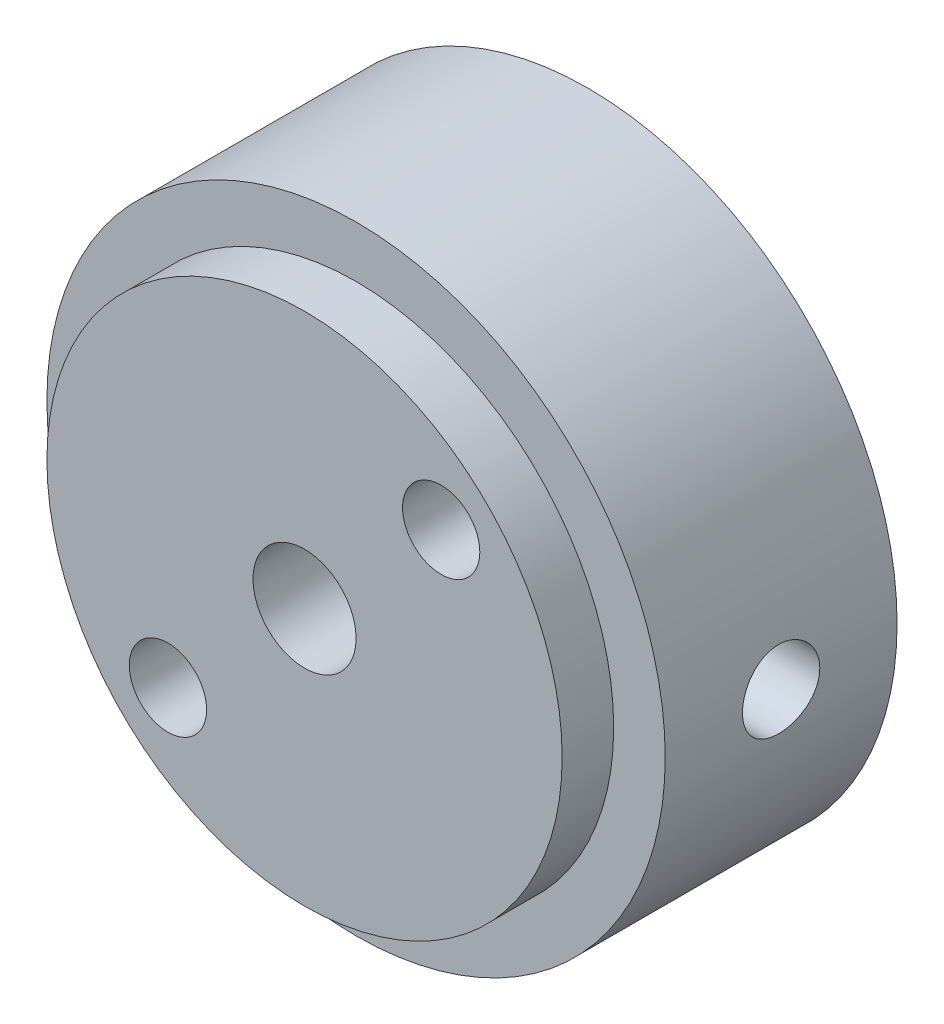
ISO-10303-21;
HEADER;
FILE_DESCRIPTION(('STEP AP214'),'2;1');
FILE_NAME('part.step','',(''),(''),'','','');
FILE_SCHEMA(('AUTOMOTIVE_DESIGN { 1 0 10303 214 1 1 1 1 }'));
ENDSEC;
DATA;
#1=APPLICATION_CONTEXT('core data for automotive mechanical design processes');
#2=APPLICATION_PROTOCOL_DEFINITION('international standard','automotive_design',2000,#1);
#3=PRODUCT_CONTEXT('',#1,'mechanical');
#4=PRODUCT('Part','Part','',(#3));
#5=PRODUCT_RELATED_PRODUCT_CATEGORY('part','',(#4));
#6=PRODUCT_DEFINITION_FORMATION('','',#4);
#7=PRODUCT_DEFINITION_CONTEXT('part definition',#1,'design');
#8=PRODUCT_DEFINITION('design','',#6,#7);
#9=PRODUCT_DEFINITION_SHAPE('','',#8);
#10=(LENGTH_UNIT() NAMED_UNIT(*) SI_UNIT(.MILLI.,.METRE.));
#11=(NAMED_UNIT(*) PLANE_ANGLE_UNIT() SI_UNIT($,.RADIAN.));
#12=(NAMED_UNIT(*) SI_UNIT($,.STERADIAN.) SOLID_ANGLE_UNIT());
#13=UNCERTAINTY_MEASURE_WITH_UNIT(LENGTH_MEASURE(1.E-05),#10,'distance_accuracy_value','');
#14=(GEOMETRIC_REPRESENTATION_CONTEXT(3) GLOBAL_UNCERTAINTY_ASSIGNED_CONTEXT((#13)) GLOBAL_UNIT_ASSIGNED_CONTEXT((#10,
#11,#12)) REPRESENTATION_CONTEXT('',''));
#15=CARTESIAN_POINT('',(0.,0.,0.));
#16=DIRECTION('',(0.,0.,1.));
#17=DIRECTION('',(1.,0.,0.));
#18=AXIS2_PLACEMENT_3D('',#15,#16,#17);
#19=CARTESIAN_POINT('',(0.,0.,9.));
#20=DIRECTION('',(0.,0.,-1.));
#21=DIRECTION('',(-1.,0.,0.));
#22=AXIS2_PLACEMENT_3D('',#19,#20,#21);
#23=CYLINDRICAL_SURFACE('',#22,12.);
#24=CARTESIAN_POINT('',(12.,0.,3.));
#25=CARTESIAN_POINT('',(11.9999988293786,-0.0839046573334145,3.00000356456143));
#26=CARTESIAN_POINT('',(11.9991107073294,-0.167861744581606,3.00706372750157));
#27=CARTESIAN_POINT('',(11.9956532406682,-0.333439681253809,3.03511665274248));
#28=CARTESIAN_POINT('',(11.9930821406486,-0.415057998374204,3.05612396275403));
#29=CARTESIAN_POINT('',(11.9865483662664,-0.57353734488779,3.11144258634845));
#30=CARTESIAN_POINT('',(11.9825866287333,-0.65040153608764,3.14574494508591));
#31=CARTESIAN_POINT('',(11.9737122052686,-0.797267684935778,3.22666037038187));
#32=CARTESIAN_POINT('',(11.9687996825047,-0.867270816933779,3.27327132511843));
#33=CARTESIAN_POINT('',(11.958541927838,-0.998827690158747,3.37775516990375));
#34=CARTESIAN_POINT('',(11.9531946881545,-1.06033821896223,3.43568227760774));
#35=CARTESIAN_POINT('',(11.9426863560585,-1.17279167613445,3.56103769412198));
#36=CARTESIAN_POINT('',(11.9375252731456,-1.22373406583531,3.62846648694795));
#37=CARTESIAN_POINT('',(11.9279538337175,-1.31376609677032,3.7711919865394));
#38=CARTESIAN_POINT('',(11.9235460630675,-1.3528152575646,3.84651441694076));
#39=CARTESIAN_POINT('',(11.9160067707461,-1.41769384594503,4.00271223116841));
#40=CARTESIAN_POINT('',(11.9128752006788,-1.44352377483909,4.08358740428821));
#41=CARTESIAN_POINT('',(11.9082620376217,-1.48109938801482,4.24814651735206));
#42=CARTESIAN_POINT('',(11.9067719006205,-1.49291802883898,4.33181355462251));
#43=CARTESIAN_POINT('',(11.9055841688568,-1.5023613297343,4.4999557580831));
#44=CARTESIAN_POINT('',(11.9058865020091,-1.49998656060141,4.58443089163877));
#45=CARTESIAN_POINT('',(11.9082417322185,-1.4811703418687,4.75128289634927));
#46=CARTESIAN_POINT('',(11.910284627762,-1.46480925779078,4.83366899172016));
#47=CARTESIAN_POINT('',(11.9158751985458,-1.41861022990919,4.99451701273139));
#48=CARTESIAN_POINT('',(11.9194229042743,-1.3887720130511,5.07297885882842));
#49=CARTESIAN_POINT('',(11.9276346951879,-1.31637933594695,5.22400079941301));
#50=CARTESIAN_POINT('',(11.9323018392687,-1.27378995222454,5.29654398014939));
#51=CARTESIAN_POINT('',(11.9422242685836,-1.17712888167411,5.43348401664795));
#52=CARTESIAN_POINT('',(11.947479580714,-1.12305666964842,5.49788049958421));
#53=CARTESIAN_POINT('',(11.9580306593426,-1.00451946645223,5.61716562643364));
#54=CARTESIAN_POINT('',(11.9633264543213,-0.939985204703967,5.67198545505959));
#55=CARTESIAN_POINT('',(11.9733277953351,-0.802594301468314,5.77002532801833));
#56=CARTESIAN_POINT('',(11.978033340009,-0.729737640790911,5.8132453456032));
#57=CARTESIAN_POINT('',(11.9863269133115,-0.577717002818048,5.88685879227835));
#58=CARTESIAN_POINT('',(11.9899145664092,-0.49855091720259,5.91724791232874));
#59=CARTESIAN_POINT('',(11.9955647146804,-0.336184764258593,5.96428229611395));
#60=CARTESIAN_POINT('',(11.9976272812552,-0.25298488597836,5.98092820328223));
#61=CARTESIAN_POINT('',(11.9999855784646,-0.0855078983480581,5.99991445455633));
#62=CARTESIAN_POINT('',(12.0002930168558,-0.0012416941191239,6.00234959541844));
#63=CARTESIAN_POINT('',(11.9991380280326,0.166497621898538,5.99309535956643));
#64=CARTESIAN_POINT('',(11.9976756385093,0.249970750538864,5.98140628364905));
#65=CARTESIAN_POINT('',(11.9931526125402,0.413474704632954,5.94431417473537));
#66=CARTESIAN_POINT('',(11.9900972448832,0.493515942254863,5.91895634195842));
#67=CARTESIAN_POINT('',(11.9827303386012,0.648209792915084,5.85529352885225));
#68=CARTESIAN_POINT('',(11.9784187573237,0.722862222879229,5.81698810890514));
#69=CARTESIAN_POINT('',(11.9689909374607,0.865082712412496,5.72828811749553));
#70=CARTESIAN_POINT('',(11.963870664255,0.932612255966332,5.67783222611662));
#71=CARTESIAN_POINT('',(11.9534108539539,1.05827819377583,5.56635030147948));
#72=CARTESIAN_POINT('',(11.9480713081614,1.11641421500216,5.50532384864941));
#73=CARTESIAN_POINT('',(11.9377386327755,1.22197917529085,5.37401554994572));
#74=CARTESIAN_POINT('',(11.932747648328,1.2693452763408,5.30368299221376));
#75=CARTESIAN_POINT('',(11.9237124662229,1.35159173366614,5.15600505308717));
#76=CARTESIAN_POINT('',(11.9196682495862,1.38647234023706,5.07865981231409));
#77=CARTESIAN_POINT('',(11.912999102358,1.44265594731997,4.91935480851143));
#78=CARTESIAN_POINT('',(11.9103704711087,1.46399437647431,4.83740770197122));
#79=CARTESIAN_POINT('',(11.9068194954447,1.49260199632075,4.6710585097316));
#80=CARTESIAN_POINT('',(11.9058970716527,1.4998718415215,4.5866565384246));
#81=CARTESIAN_POINT('',(11.9058652618947,1.50012392165094,4.41841864247719));
#82=CARTESIAN_POINT('',(11.9067433485117,1.49320487861961,4.33458285100087));
#83=CARTESIAN_POINT('',(11.9101866872232,1.46548464290964,4.16927572239296));
#84=CARTESIAN_POINT('',(11.9127519394985,1.4446834487435,4.08780438551472));
#85=CARTESIAN_POINT('',(11.9192766946473,1.38982024421384,3.92955182594016));
#86=CARTESIAN_POINT('',(11.9232356975567,1.3557629885826,3.85276893298691));
#87=CARTESIAN_POINT('',(11.9321026994689,1.27536414129023,3.70599200757101));
#88=CARTESIAN_POINT('',(11.9370107103625,1.2290223957058,3.6359980601881));
#89=CARTESIAN_POINT('',(11.9472636285134,1.12500379875955,3.50428126479572));
#90=CARTESIAN_POINT('',(11.9526112325042,1.06725337546502,3.44261672342701));
#91=CARTESIAN_POINT('',(11.9631169895574,0.942210136181072,3.32981590489922));
#92=CARTESIAN_POINT('',(11.9682750976535,0.874915073484983,3.27868211353541));
#93=CARTESIAN_POINT('',(11.9778423395205,0.73239937251257,3.18822878573682));
#94=CARTESIAN_POINT('',(11.9822485504698,0.657149567757745,3.14895491646045));
#95=CARTESIAN_POINT('',(11.9897858944604,0.501109741380812,3.08365725425023));
#96=CARTESIAN_POINT('',(11.9929184122175,0.420325848522185,3.05761906418793));
#97=CARTESIAN_POINT('',(11.9968003219665,0.282603463180797,3.02576439709722));
#98=CARTESIAN_POINT('',(11.9979943553727,0.226533398110194,3.01611663481076));
#99=CARTESIAN_POINT('',(11.9995945879751,0.113650237927502,3.00323325258407));
#100=CARTESIAN_POINT('',(12.0000007929809,0.056837148297658,2.99999758536042));
#101=CARTESIAN_POINT('',(12.,0.,3.));
#102=B_SPLINE_CURVE_WITH_KNOTS('',3,(#24,#25,#26,#27,#28,#29,#30,#31,#32,#33,#34,#35,#36,#37,
#38,#39,#40,#41,#42,#43,#44,#45,#46,#47,#48,#49,#50,#51,#52,#53,#54,#55,#56,#57,#58,#59,#60,#61,
#62,#63,#64,#65,#66,#67,#68,#69,#70,#71,#72,#73,#74,#75,#76,#77,#78,#79,#80,#81,#82,#83,#84,#85,
#86,#87,#88,#89,#90,#91,#92,#93,#94,#95,#96,#97,#98,#99,#100,#101),.UNSPECIFIED.,.T.,.F.,(4,2,2,
2,2,2,2,2,2,2,2,2,2,2,2,2,2,2,2,2,2,2,2,2,2,2,2,2,2,2,2,2,2,2,2,2,2,2,4),(0.,0.251506363665748,
0.503275476566056,0.754875304909062,1.00643199354644,1.25922487921106,1.51203064680006,
1.76568750191322,2.01933473698084,2.27165535171792,2.52396581930798,2.77483617865015,
3.02571162099745,3.2772805577132,3.52886100308183,3.7821808688185,4.03550131867868,
4.28890677438963,4.54230036542268,4.79400167635153,5.04569762701157,5.29656632336038,
5.54744353847369,5.79961441757053,6.05179530825053,6.30541182904544,6.55902326532923,
6.81196844568555,7.06490185806374,7.31608140721329,7.56726098327729,7.81835054823893,
8.06944325947359,8.32221142615098,8.57503919082008,8.82882841822112,9.0823409921042,
9.25271305912577,9.42308386980262),.UNSPECIFIED.);
#103=CARTESIAN_POINT('',(12.,0.,3.));
#104=VERTEX_POINT('',#103);
#105=EDGE_CURVE('E57',#104,#104,#102,.T.);
#106=ORIENTED_EDGE('',*,*,#105,.T.);
#107=EDGE_LOOP('',(#106));
#108=FACE_BOUND('',#107,.T.);
#109=CARTESIAN_POINT('',(0.,-12.,6.));
#110=CARTESIAN_POINT('',(0.0839046573334569,-11.9999988293786,5.99999643543857));
#111=CARTESIAN_POINT('',(0.167861744581648,-11.9991107073294,5.99293627249843));
#112=CARTESIAN_POINT('',(0.333439681253852,-11.9956532406682,5.96488334725752));
#113=CARTESIAN_POINT('',(0.415057998374247,-11.9930821406486,5.94387603724597));
#114=CARTESIAN_POINT('',(0.573537344887832,-11.9865483662664,5.88855741365155));
#115=CARTESIAN_POINT('',(0.650401536087683,-11.9825866287333,5.85425505491409));
#116=CARTESIAN_POINT('',(0.797267684935821,-11.9737122052686,5.77333962961812));
#117=CARTESIAN_POINT('',(0.867270816933823,-11.9687996825047,5.72672867488157));
#118=CARTESIAN_POINT('',(0.99882769015879,-11.958541927838,5.62224483009625));
#119=CARTESIAN_POINT('',(1.06033821896228,-11.9531946881545,5.56431772239226));
#120=CARTESIAN_POINT('',(1.1727916761345,-11.9426863560585,5.43896230587801));
#121=CARTESIAN_POINT('',(1.22373406583535,-11.9375252731456,5.37153351305205));
#122=CARTESIAN_POINT('',(1.31376609677036,-11.9279538337175,5.2288080134606));
#123=CARTESIAN_POINT('',(1.35281525756464,-11.9235460630675,5.15348558305923));
#124=CARTESIAN_POINT('',(1.41769384594507,-11.9160067707461,4.99728776883158));
#125=CARTESIAN_POINT('',(1.44352377483913,-11.9128752006788,4.91641259571179));
#126=CARTESIAN_POINT('',(1.48109938801486,-11.9082620376217,4.75185348264794));
#127=CARTESIAN_POINT('',(1.49291802883902,-11.9067719006205,4.66818644537748));
#128=CARTESIAN_POINT('',(1.50236132973434,-11.9055841688568,4.5000442419169));
#129=CARTESIAN_POINT('',(1.49998656060145,-11.9058865020091,4.41556910836123));
#130=CARTESIAN_POINT('',(1.48117034186874,-11.9082417322185,4.24871710365073));
#131=CARTESIAN_POINT('',(1.46480925779082,-11.910284627762,4.16633100827984));
#132=CARTESIAN_POINT('',(1.41861022990923,-11.9158751985458,4.00548298726861));
#133=CARTESIAN_POINT('',(1.38877201305114,-11.9194229042743,3.92702114117158));
#134=CARTESIAN_POINT('',(1.31637933594699,-11.9276346951879,3.77599920058699));
#135=CARTESIAN_POINT('',(1.27378995222458,-11.9323018392687,3.70345601985061));
#136=CARTESIAN_POINT('',(1.17712888167415,-11.9422242685836,3.56651598335205));
#137=CARTESIAN_POINT('',(1.12305666964847,-11.947479580714,3.50211950041579));
#138=CARTESIAN_POINT('',(1.00451946645227,-11.9580306593426,3.38283437356636));
#139=CARTESIAN_POINT('',(0.939985204704008,-11.9633264543213,3.32801454494041));
#140=CARTESIAN_POINT('',(0.802594301468354,-11.9733277953351,3.22997467198167));
#141=CARTESIAN_POINT('',(0.729737640790952,-11.978033340009,3.1867546543968));
#142=CARTESIAN_POINT('',(0.577717002818089,-11.9863269133115,3.11314120772165));
#143=CARTESIAN_POINT('',(0.498550917202631,-11.9899145664092,3.08275208767126));
#144=CARTESIAN_POINT('',(0.336184764258634,-11.9955647146804,3.03571770388605));
#145=CARTESIAN_POINT('',(0.252984885978401,-11.9976272812552,3.01907179671777));
#146=CARTESIAN_POINT('',(0.0855078983480989,-11.9999855784646,3.00008554544367));
#147=CARTESIAN_POINT('',(0.00124169411916476,-12.0002930168558,2.99765040458156));
#148=CARTESIAN_POINT('',(-0.166497621898497,-11.9991380280326,3.00690464043357));
#149=CARTESIAN_POINT('',(-0.249970750538823,-11.9976756385093,3.01859371635095));
#150=CARTESIAN_POINT('',(-0.413474704632913,-11.9931526125402,3.05568582526463));
#151=CARTESIAN_POINT('',(-0.493515942254822,-11.9900972448832,3.08104365804158));
#152=CARTESIAN_POINT('',(-0.648209792915043,-11.9827303386012,3.14470647114775));
#153=CARTESIAN_POINT('',(-0.722862222879188,-11.9784187573237,3.18301189109486));
#154=CARTESIAN_POINT('',(-0.865082712412455,-11.9689909374607,3.27171188250447));
#155=CARTESIAN_POINT('',(-0.932612255966291,-11.9638706642551,3.32216777388338));
#156=CARTESIAN_POINT('',(-1.05827819377579,-11.9534108539539,3.43364969852052));
#157=CARTESIAN_POINT('',(-1.11641421500211,-11.9480713081614,3.49467615135059));
#158=CARTESIAN_POINT('',(-1.22197917529081,-11.9377386327755,3.62598445005428));
#159=CARTESIAN_POINT('',(-1.26934527634076,-11.932747648328,3.69631700778623));
#160=CARTESIAN_POINT('',(-1.3515917336661,-11.9237124662229,3.84399494691283));
#161=CARTESIAN_POINT('',(-1.38647234023702,-11.9196682495862,3.92134018768591));
#162=CARTESIAN_POINT('',(-1.44265594731992,-11.912999102358,4.08064519148857));
#163=CARTESIAN_POINT('',(-1.46399437647427,-11.9103704711087,4.16259229802878));
#164=CARTESIAN_POINT('',(-1.49260199632071,-11.9068194954447,4.3289414902684));
#165=CARTESIAN_POINT('',(-1.49987184152146,-11.9058970716527,4.4133434615754));
#166=CARTESIAN_POINT('',(-1.5001239216509,-11.9058652618947,4.58158135752281));
#167=CARTESIAN_POINT('',(-1.49320487861956,-11.9067433485117,4.66541714899913));
#168=CARTESIAN_POINT('',(-1.4654846429096,-11.9101866872232,4.83072427760704));
#169=CARTESIAN_POINT('',(-1.44468344874346,-11.9127519394985,4.91219561448528));
#170=CARTESIAN_POINT('',(-1.38982024421379,-11.9192766946473,5.07044817405984));
#171=CARTESIAN_POINT('',(-1.35576298858256,-11.9232356975567,5.14723106701309));
#172=CARTESIAN_POINT('',(-1.27536414129019,-11.9321026994689,5.29400799242899));
#173=CARTESIAN_POINT('',(-1.22902239570575,-11.9370107103625,5.36400193981189));
#174=CARTESIAN_POINT('',(-1.1250037987595,-11.9472636285134,5.49571873520428));
#175=CARTESIAN_POINT('',(-1.06725337546498,-11.9526112325042,5.55738327657299));
#176=CARTESIAN_POINT('',(-0.94221013618103,-11.9631169895574,5.67018409510078));
#177=CARTESIAN_POINT('',(-0.874915073484941,-11.9682750976535,5.72131788646459));
#178=CARTESIAN_POINT('',(-0.732399372512527,-11.9778423395205,5.81177121426318));
#179=CARTESIAN_POINT('',(-0.657149567757702,-11.9822485504698,5.85104508353955));
#180=CARTESIAN_POINT('',(-0.501109741380769,-11.9897858944604,5.91634274574977));
#181=CARTESIAN_POINT('',(-0.420325848522142,-11.9929184122175,5.94238093581207));
#182=CARTESIAN_POINT('',(-0.282603463180755,-11.9968003219665,5.97423560290278));
#183=CARTESIAN_POINT('',(-0.226533398110153,-11.9979943553727,5.98388336518924));
#184=CARTESIAN_POINT('',(-0.113650237927461,-11.9995945879751,5.99676674741593));
#185=CARTESIAN_POINT('',(-0.0568371482976164,-12.0000007929808,6.00000241463958));
#186=CARTESIAN_POINT('',(0.,-12.,6.));
#187=B_SPLINE_CURVE_WITH_KNOTS('',3,(#109,#110,#111,#112,#113,#114,#115,#116,#117,#118,#119,
#120,#121,#122,#123,#124,#125,#126,#127,#128,#129,#130,#131,#132,#133,#134,#135,#136,#137,#138,
#139,#140,#141,#142,#143,#144,#145,#146,#147,#148,#149,#150,#151,#152,#153,#154,#155,#156,#157,
#158,#159,#160,#161,#162,#163,#164,#165,#166,#167,#168,#169,#170,#171,#172,#173,#174,#175,#176,
#177,#178,#179,#180,#181,#182,#183,#184,#185,#186),.UNSPECIFIED.,.T.,.F.,(4,2,2,2,2,2,2,2,2,2,2,
2,2,2,2,2,2,2,2,2,2,2,2,2,2,2,2,2,2,2,2,2,2,2,2,2,2,2,4),(0.,0.251506363665748,
0.503275476566056,0.754875304909062,1.00643199354644,1.25922487921106,1.51203064680006,
1.76568750191322,2.01933473698084,2.27165535171792,2.52396581930798,2.77483617865015,
3.02571162099745,3.2772805577132,3.52886100308183,3.7821808688185,4.03550131867868,
4.28890677438963,4.54230036542268,4.79400167635153,5.04569762701157,5.29656632336038,
5.54744353847369,5.79961441757053,6.05179530825053,6.30541182904544,6.55902326532923,
6.81196844568555,7.06490185806374,7.31608140721329,7.56726098327729,7.81835054823893,
8.06944325947358,8.32221142615098,8.57503919082008,8.82882841822112,9.0823409921042,
9.25271305912577,9.42308386980262),.UNSPECIFIED.);
#188=CARTESIAN_POINT('',(0.,-12.,6.));
#189=VERTEX_POINT('',#188);
#190=EDGE_CURVE('E61',#189,#189,#187,.T.);
#191=ORIENTED_EDGE('',*,*,#190,.T.);
#192=EDGE_LOOP('',(#191));
#193=FACE_BOUND('',#192,.T.);
#194=CARTESIAN_POINT('',(0.,0.,9.));
#195=DIRECTION('',(0.,0.,1.));
#196=DIRECTION('',(1.,0.,0.));
#197=AXIS2_PLACEMENT_3D('',#194,#195,#196);
#198=CIRCLE('',#197,12.);
#199=CARTESIAN_POINT('',(12.,0.,9.));
#200=VERTEX_POINT('',#199);
#201=EDGE_CURVE('E41',#200,#200,#198,.T.);
#202=ORIENTED_EDGE('',*,*,#201,.F.);
#203=EDGE_LOOP('',(#202));
#204=FACE_BOUND('',#203,.T.);
#205=CARTESIAN_POINT('',(0.,0.,0.));
#206=DIRECTION('',(0.,0.,1.));
#207=DIRECTION('',(1.,0.,0.));
#208=AXIS2_PLACEMENT_3D('',#205,#206,#207);
#209=CIRCLE('',#208,12.);
#210=CARTESIAN_POINT('',(12.,0.,0.));
#211=VERTEX_POINT('',#210);
#212=EDGE_CURVE('E72',#211,#211,#209,.T.);
#213=ORIENTED_EDGE('',*,*,#212,.T.);
#214=EDGE_LOOP('',(#213));
#215=FACE_BOUND('',#214,.T.);
#216=ADVANCED_FACE('F33',(#108,#193,#204,#215),#23,.T.);
#217=CARTESIAN_POINT('',(0.,0.,9.));
#218=DIRECTION('',(0.,0.,1.));
#219=DIRECTION('',(1.,0.,0.));
#220=AXIS2_PLACEMENT_3D('',#217,#218,#219);
#221=PLANE('',#220);
#222=CARTESIAN_POINT('',(0.,0.,9.));
#223=DIRECTION('',(0.,0.,1.));
#224=DIRECTION('',(1.,0.,0.));
#225=AXIS2_PLACEMENT_3D('',#222,#223,#224);
#226=CIRCLE('',#225,10.);
#227=CARTESIAN_POINT('',(10.,0.,9.));
#228=VERTEX_POINT('',#227);
#229=EDGE_CURVE('E103',#228,#228,#226,.T.);
#230=ORIENTED_EDGE('',*,*,#229,.F.);
#231=EDGE_LOOP('',(#230));
#232=FACE_BOUND('',#231,.T.);
#233=ORIENTED_EDGE('',*,*,#201,.T.);
#234=EDGE_LOOP('',(#233));
#235=FACE_BOUND('',#234,.T.);
#236=ADVANCED_FACE('F120',(#232,#235),#221,.T.);
#237=CARTESIAN_POINT('',(0.,0.,0.));
#238=DIRECTION('',(0.,0.,1.));
#239=DIRECTION('',(1.,0.,0.));
#240=AXIS2_PLACEMENT_3D('',#237,#238,#239);
#241=PLANE('',#240);
#242=CARTESIAN_POINT('',(5.30330085889909,5.30330085889912,0.));
#243=DIRECTION('',(0.,0.,1.));
#244=DIRECTION('',(1.,0.,0.));
#245=AXIS2_PLACEMENT_3D('',#242,#243,#244);
#246=CIRCLE('',#245,1.5);
#247=CARTESIAN_POINT('',(6.80330085889909,5.30330085889912,0.));
#248=VERTEX_POINT('',#247);
#249=EDGE_CURVE('E88',#248,#248,#246,.T.);
#250=ORIENTED_EDGE('',*,*,#249,.T.);
#251=EDGE_LOOP('',(#250));
#252=FACE_BOUND('',#251,.T.);
#253=CARTESIAN_POINT('',(0.,0.,0.));
#254=DIRECTION('',(0.,0.,1.));
#255=DIRECTION('',(1.,0.,0.));
#256=AXIS2_PLACEMENT_3D('',#253,#254,#255);
#257=CIRCLE('',#256,2.);
#258=CARTESIAN_POINT('',(2.,0.,0.));
#259=VERTEX_POINT('',#258);
#260=EDGE_CURVE('E95',#259,#259,#257,.T.);
#261=ORIENTED_EDGE('',*,*,#260,.T.);
#262=EDGE_LOOP('',(#261));
#263=FACE_BOUND('',#262,.T.);
#264=CARTESIAN_POINT('',(-5.3033008588991,-5.30330085889912,0.));
#265=DIRECTION('',(0.,0.,1.));
#266=DIRECTION('',(1.,0.,0.));
#267=AXIS2_PLACEMENT_3D('',#264,#265,#266);
#268=CIRCLE('',#267,1.5);
#269=CARTESIAN_POINT('',(-3.8033008588991,-5.30330085889912,0.));
#270=VERTEX_POINT('',#269);
#271=EDGE_CURVE('E100',#270,#270,#268,.T.);
#272=ORIENTED_EDGE('',*,*,#271,.T.);
#273=EDGE_LOOP('',(#272));
#274=FACE_BOUND('',#273,.T.);
#275=ORIENTED_EDGE('',*,*,#212,.F.);
#276=EDGE_LOOP('',(#275));
#277=FACE_BOUND('',#276,.T.);
#278=ADVANCED_FACE('F117',(#252,#263,#274,#277),#241,.F.);
#279=CARTESIAN_POINT('',(0.,0.,11.));
#280=DIRECTION('',(0.,0.,-1.));
#281=DIRECTION('',(-1.,0.,0.));
#282=AXIS2_PLACEMENT_3D('',#279,#280,#281);
#283=CYLINDRICAL_SURFACE('',#282,10.);
#284=CARTESIAN_POINT('',(0.,0.,11.));
#285=DIRECTION('',(0.,0.,1.));
#286=DIRECTION('',(1.,0.,0.));
#287=AXIS2_PLACEMENT_3D('',#284,#285,#286);
#288=CIRCLE('',#287,10.);
#289=CARTESIAN_POINT('',(10.,0.,11.));
#290=VERTEX_POINT('',#289);
#291=EDGE_CURVE('E106',#290,#290,#288,.T.);
#292=ORIENTED_EDGE('',*,*,#291,.F.);
#293=EDGE_LOOP('',(#292));
#294=FACE_BOUND('',#293,.T.);
#295=ORIENTED_EDGE('',*,*,#229,.T.);
#296=EDGE_LOOP('',(#295));
#297=FACE_BOUND('',#296,.T.);
#298=ADVANCED_FACE('F119',(#294,#297),#283,.T.);
#299=CARTESIAN_POINT('',(0.,0.,11.));
#300=DIRECTION('',(0.,0.,1.));
#301=DIRECTION('',(1.,0.,0.));
#302=AXIS2_PLACEMENT_3D('',#299,#300,#301);
#303=PLANE('',#302);
#304=CARTESIAN_POINT('',(5.30330085889909,5.30330085889912,11.));
#305=DIRECTION('',(0.,0.,1.));
#306=DIRECTION('',(1.,0.,0.));
#307=AXIS2_PLACEMENT_3D('',#304,#305,#306);
#308=CIRCLE('',#307,1.5);
#309=CARTESIAN_POINT('',(6.80330085889909,5.30330085889912,11.));
#310=VERTEX_POINT('',#309);
#311=EDGE_CURVE('E92',#310,#310,#308,.T.);
#312=ORIENTED_EDGE('',*,*,#311,.F.);
#313=EDGE_LOOP('',(#312));
#314=FACE_BOUND('',#313,.T.);
#315=CARTESIAN_POINT('',(0.,0.,11.));
#316=DIRECTION('',(0.,0.,1.));
#317=DIRECTION('',(1.,0.,0.));
#318=AXIS2_PLACEMENT_3D('',#315,#316,#317);
#319=CIRCLE('',#318,2.);
#320=CARTESIAN_POINT('',(2.,0.,11.));
#321=VERTEX_POINT('',#320);
#322=EDGE_CURVE('E63',#321,#321,#319,.T.);
#323=ORIENTED_EDGE('',*,*,#322,.F.);
#324=EDGE_LOOP('',(#323));
#325=FACE_BOUND('',#324,.T.);
#326=CARTESIAN_POINT('',(-5.3033008588991,-5.30330085889912,11.));
#327=DIRECTION('',(0.,0.,1.));
#328=DIRECTION('',(1.,0.,0.));
#329=AXIS2_PLACEMENT_3D('',#326,#327,#328);
#330=CIRCLE('',#329,1.5);
#331=CARTESIAN_POINT('',(-3.8033008588991,-5.30330085889912,11.));
#332=VERTEX_POINT('',#331);
#333=EDGE_CURVE('E91',#332,#332,#330,.T.);
#334=ORIENTED_EDGE('',*,*,#333,.F.);
#335=EDGE_LOOP('',(#334));
#336=FACE_BOUND('',#335,.T.);
#337=ORIENTED_EDGE('',*,*,#291,.T.);
#338=EDGE_LOOP('',(#337));
#339=FACE_BOUND('',#338,.T.);
#340=ADVANCED_FACE('F126',(#314,#325,#336,#339),#303,.T.);
#341=CARTESIAN_POINT('',(-5.3033008588991,-5.30330085889912,0.));
#342=DIRECTION('',(0.,0.,1.));
#343=DIRECTION('',(1.,0.,0.));
#344=AXIS2_PLACEMENT_3D('',#341,#342,#343);
#345=CYLINDRICAL_SURFACE('',#344,1.5);
#346=ORIENTED_EDGE('',*,*,#271,.F.);
#347=EDGE_LOOP('',(#346));
#348=FACE_BOUND('',#347,.T.);
#349=ORIENTED_EDGE('',*,*,#333,.T.);
#350=EDGE_LOOP('',(#349));
#351=FACE_BOUND('',#350,.T.);
#352=ADVANCED_FACE('F160',(#348,#351),#345,.F.);
#353=CARTESIAN_POINT('',(0.,0.,0.));
#354=DIRECTION('',(0.,0.,1.));
#355=DIRECTION('',(1.,0.,0.));
#356=AXIS2_PLACEMENT_3D('',#353,#354,#355);
#357=CYLINDRICAL_SURFACE('',#356,2.);
#358=CARTESIAN_POINT('',(0.,-2.,6.));
#359=CARTESIAN_POINT('',(-0.0732207358411542,-1.99999540196395,5.99999520798798));
#360=CARTESIAN_POINT('',(-0.146561062021485,-1.99593645526274,5.9945949756255));
#361=CARTESIAN_POINT('',(-0.290936396286467,-1.98006607281083,5.97333293658984));
#362=CARTESIAN_POINT('',(-0.361965136229004,-1.96823514679854,5.95744482834994));
#363=CARTESIAN_POINT('',(-0.499234626631249,-1.9379567495606,5.91628709071623));
#364=CARTESIAN_POINT('',(-0.565501615403736,-1.91954951932009,5.89107448643083));
#365=CARTESIAN_POINT('',(-0.692422335520752,-1.87750556721694,5.83245765581277));
#366=CARTESIAN_POINT('',(-0.753077701796332,-1.85387037535483,5.79905582580648));
#367=CARTESIAN_POINT('',(-0.873465937590144,-1.80049544543983,5.72173698840918));
#368=CARTESIAN_POINT('',(-0.932593229272031,-1.7703930854844,5.67713267066593));
#369=CARTESIAN_POINT('',(-1.0430271676767,-1.70767017883378,5.58050416263883));
#370=CARTESIAN_POINT('',(-1.09432148272226,-1.67504578078609,5.52846851720017));
#371=CARTESIAN_POINT('',(-1.19837161436623,-1.6027112365199,5.40641704672163));
#372=CARTESIAN_POINT('',(-1.24930578421204,-1.56290854864639,5.3348963228783));
#373=CARTESIAN_POINT('',(-1.33861998176348,-1.48711444664135,5.18254898763346));
#374=CARTESIAN_POINT('',(-1.37701716983077,-1.45111786883675,5.10173530299969));
#375=CARTESIAN_POINT('',(-1.42880627811788,-1.39977155180179,4.96049716132377));
#376=CARTESIAN_POINT('',(-1.44625674456539,-1.38157751186733,4.90260930287162));
#377=CARTESIAN_POINT('',(-1.47420672564844,-1.35171594150685,4.78360726521508));
#378=CARTESIAN_POINT('',(-1.48472215355267,-1.34003347910832,4.72250082212521));
#379=CARTESIAN_POINT('',(-1.49812822141445,-1.32503759684552,4.59781741446923));
#380=CARTESIAN_POINT('',(-1.50094954854207,-1.32180026676597,4.53422319327595));
#381=CARTESIAN_POINT('',(-1.49848213241869,-1.32459531776068,4.40738508911843));
#382=CARTESIAN_POINT('',(-1.49319048157349,-1.33063102218113,4.34414133991256));
#383=CARTESIAN_POINT('',(-1.47597739291882,-1.34967623262519,4.22680865257421));
#384=CARTESIAN_POINT('',(-1.46482486380817,-1.36187157059871,4.17246362895381));
#385=CARTESIAN_POINT('',(-1.43705671120732,-1.39114192844939,4.06656112127912));
#386=CARTESIAN_POINT('',(-1.42043583681172,-1.40822163640769,4.0150063721764));
#387=CARTESIAN_POINT('',(-1.37033064172535,-1.45741769294306,3.88374361336585));
#388=CARTESIAN_POINT('',(-1.3328014849398,-1.49225649139233,3.80659958335649));
#389=CARTESIAN_POINT('',(-1.24618023314519,-1.56533298145196,3.66080347613091));
#390=CARTESIAN_POINT('',(-1.19706004255878,-1.60357878886109,3.59217266074534));
#391=CARTESIAN_POINT('',(-1.08651604102135,-1.68051672313145,3.46224660959634));
#392=CARTESIAN_POINT('',(-1.02481375526036,-1.71919586730239,3.40117939311851));
#393=CARTESIAN_POINT('',(-0.890422521709587,-1.79248037980972,3.28973635321883));
#394=CARTESIAN_POINT('',(-0.817755054293754,-1.8270934826376,3.23934007976962));
#395=CARTESIAN_POINT('',(-0.67790208045414,-1.88279726073643,3.16001920075967));
#396=CARTESIAN_POINT('',(-0.612539870185617,-1.90520770945008,3.12881540578422));
#397=CARTESIAN_POINT('',(-0.476352173202084,-1.94372904416948,3.07577511953613));
#398=CARTESIAN_POINT('',(-0.405530141063764,-1.95984387504352,3.05393276150072));
#399=CARTESIAN_POINT('',(-0.259676232483517,-1.98445588635989,3.02074663711356));
#400=CARTESIAN_POINT('',(-0.184621281405941,-1.99290592971749,3.00946782106137));
#401=CARTESIAN_POINT('',(-0.0332012397969159,-2.00115883659445,2.99845040262829));
#402=CARTESIAN_POINT('',(0.0431632843727245,-2.00096534845408,2.99870693130463));
#403=CARTESIAN_POINT('',(0.186804217329626,-1.99242547175873,3.01011086927319));
#404=CARTESIAN_POINT('',(0.254222327546134,-1.98490086600401,3.02016053688867));
#405=CARTESIAN_POINT('',(0.386110670609119,-1.96351320201588,3.04897378000787));
#406=CARTESIAN_POINT('',(0.450580272987261,-1.94964879507262,3.06773920968941));
#407=CARTESIAN_POINT('',(0.577416779689769,-1.91599830683313,3.1138875305931));
#408=CARTESIAN_POINT('',(0.639629172536139,-1.89602050290193,3.1415511814274));
#409=CARTESIAN_POINT('',(0.758518527043073,-1.85166985411963,3.20417245542559));
#410=CARTESIAN_POINT('',(0.815194721336403,-1.82729640132068,3.23913108763973));
#411=CARTESIAN_POINT('',(0.931511626319037,-1.77119146886499,3.32178324641056));
#412=CARTESIAN_POINT('',(0.990066762698701,-1.73891095025037,3.37062853943745));
#413=CARTESIAN_POINT('',(1.09871974855854,-1.67238952874785,3.47600875258839));
#414=CARTESIAN_POINT('',(1.14879830469577,-1.63814438507395,3.53256069969336));
#415=CARTESIAN_POINT('',(1.24877541075626,-1.56369128291496,3.66414988096118));
#416=CARTESIAN_POINT('',(1.29683043648705,-1.523587185201,3.7406575614923));
#417=CARTESIAN_POINT('',(1.37923235998283,-1.4494059134845,3.90336007797245));
#418=CARTESIAN_POINT('',(1.41362000515519,-1.41531099570969,3.98952512190857));
#419=CARTESIAN_POINT('',(1.45615734256767,-1.37118877808583,4.13541444887448));
#420=CARTESIAN_POINT('',(1.46931009512996,-1.35695811824564,4.19239112640238));
#421=CARTESIAN_POINT('',(1.48891522181906,-1.3354205610301,4.30870704698318));
#422=CARTESIAN_POINT('',(1.4953825519924,-1.32809821220233,4.36804070680225));
#423=CARTESIAN_POINT('',(1.50115320209064,-1.32157601792209,4.48782907981133));
#424=CARTESIAN_POINT('',(1.50042015325262,-1.32241740684975,4.54828794300957));
#425=CARTESIAN_POINT('',(1.49176883838219,-1.33216448543666,4.66805683875216));
#426=CARTESIAN_POINT('',(1.48384130024584,-1.34108058157484,4.72736528789726));
#427=CARTESIAN_POINT('',(1.45893841819723,-1.36817348797773,4.8559145714108));
#428=CARTESIAN_POINT('',(1.44036567954111,-1.38794705950643,4.92449718013278));
#429=CARTESIAN_POINT('',(1.39469627266119,-1.4338296338541,5.05653484883049));
#430=CARTESIAN_POINT('',(1.3675780729773,-1.4599546014693,5.11997644203819));
#431=CARTESIAN_POINT('',(1.29498918933642,-1.52516477328824,5.26252063048634));
#432=CARTESIAN_POINT('',(1.2464154206597,-1.56560203191105,5.33942158275576));
#433=CARTESIAN_POINT('',(1.13650718465936,-1.64713510181273,5.48312604497757));
#434=CARTESIAN_POINT('',(1.07516134758577,-1.68823146954223,5.54992046594485));
#435=CARTESIAN_POINT('',(0.939627144937889,-1.76728988939793,5.67283184228333));
#436=CARTESIAN_POINT('',(0.865337161562858,-1.80522333711072,5.7288563193772));
#437=CARTESIAN_POINT('',(0.705159098936202,-1.87357289668097,5.82722305114535));
#438=CARTESIAN_POINT('',(0.619299420401792,-1.90400691592959,5.86959797457251));
#439=CARTESIAN_POINT('',(0.464840290356452,-1.94636704624048,5.92779942098571));
#440=CARTESIAN_POINT('',(0.39855361477473,-1.96110322499718,5.94776673137618));
#441=CARTESIAN_POINT('',(0.262841610392758,-1.98383739970238,5.97841790261149));
#442=CARTESIAN_POINT('',(0.193425623834904,-1.99185421210894,5.98912769024996));
#443=CARTESIAN_POINT('',(0.102963309861887,-1.99745471706309,5.99660469421435));
#444=CARTESIAN_POINT('',(0.0824069459941225,-1.9984076143208,5.99787627748942));
#445=CARTESIAN_POINT('',(0.0412368896243777,-1.99968095423138,5.99957467323097));
#446=CARTESIAN_POINT('',(0.0206231884283878,-2.00000129507253,6.00000134970737));
#447=CARTESIAN_POINT('',(0.,-2.,6.));
#448=B_SPLINE_CURVE_WITH_KNOTS('',3,(#358,#359,#360,#361,#362,#363,#364,#365,#366,#367,#368,
#369,#370,#371,#372,#373,#374,#375,#376,#377,#378,#379,#380,#381,#382,#383,#384,#385,#386,#387,
#388,#389,#390,#391,#392,#393,#394,#395,#396,#397,#398,#399,#400,#401,#402,#403,#404,#405,#406,
#407,#408,#409,#410,#411,#412,#413,#414,#415,#416,#417,#418,#419,#420,#421,#422,#423,#424,#425,
#426,#427,#428,#429,#430,#431,#432,#433,#434,#435,#436,#437,#438,#439,#440,#441,#442,#443,#444,
#445,#446,#447),.UNSPECIFIED.,.T.,.F.,(4,2,2,2,2,2,2,2,2,2,2,2,2,2,2,2,2,2,2,2,2,2,2,2,2,2,2,2,
2,2,2,2,2,2,2,2,2,2,2,2,2,2,2,2,4),(0.,0.219571786572042,0.439696319423243,0.658496333573381,
0.877232398849292,1.1162243131743,1.35558868405162,1.64360015887451,1.93121574056507,
2.11999518529901,2.3083399319529,2.49837587621257,2.6884799430021,2.85826890162709,
3.0282213760064,3.3044933180591,3.58144192357889,3.86535883938091,4.14872662493691,
4.3752650500639,4.60166129643118,4.82944058166899,5.05712372466614,5.26191187011994,
5.46674360185812,5.6788043948368,5.89089453977541,6.13840382081868,6.38646908985452,
6.68168596015947,6.97601595850113,7.15589161422933,7.33536399114209,7.51574333854741,
7.69635548563854,7.91639670960135,8.13699685139922,8.43412246655769,8.73151372390894,
9.0313544949265,9.33047220273165,9.5419569754163,9.75284752283257,9.81468166878711,
9.87652576630966),.UNSPECIFIED.);
#449=CARTESIAN_POINT('',(1.4142135623731,-1.41421356237309,4.99999999999999));
#450=VERTEX_POINT('',#449);
#451=CARTESIAN_POINT('',(1.41421356237639,-1.41421356236987,4.00000000000149));
#452=VERTEX_POINT('',#451);
#453=EDGE_CURVE('E56',#450,#452,#448,.T.);
#454=ORIENTED_EDGE('',*,*,#453,.T.);
#455=CARTESIAN_POINT('',(2.,0.,3.));
#456=CARTESIAN_POINT('',(1.99999540196395,0.0732207358411545,3.00000479201202));
#457=CARTESIAN_POINT('',(1.99593645526274,0.146561062021485,3.00540502437449));
#458=CARTESIAN_POINT('',(1.98006607281083,0.290936396286467,3.02666706341016));
#459=CARTESIAN_POINT('',(1.96823514679854,0.361965136229004,3.04255517165005));
#460=CARTESIAN_POINT('',(1.9379567495606,0.499234626631249,3.08371290928377));
#461=CARTESIAN_POINT('',(1.91954951932009,0.565501615403736,3.10892551356917));
#462=CARTESIAN_POINT('',(1.87750556721694,0.692422335520752,3.16754234418722));
#463=CARTESIAN_POINT('',(1.85387037535483,0.753077701796332,3.20094417419351));
#464=CARTESIAN_POINT('',(1.80049544543983,0.873465937590144,3.27826301159082));
#465=CARTESIAN_POINT('',(1.7703930854844,0.932593229272031,3.32286732933407));
#466=CARTESIAN_POINT('',(1.70767017883378,1.04302716767671,3.41949583736116));
#467=CARTESIAN_POINT('',(1.67504578078609,1.09432148272226,3.47153148279982));
#468=CARTESIAN_POINT('',(1.6027112365199,1.19837161436623,3.59358295327836));
#469=CARTESIAN_POINT('',(1.56290854864639,1.24930578421204,3.6651036771217));
#470=CARTESIAN_POINT('',(1.48711444664135,1.33861998176348,3.81745101236654));
#471=CARTESIAN_POINT('',(1.45111786883675,1.37701716983077,3.8982646970003));
#472=CARTESIAN_POINT('',(1.39977155180178,1.42880627811789,4.03950283867622));
#473=CARTESIAN_POINT('',(1.38157751186733,1.44625674456539,4.09739069712837));
#474=CARTESIAN_POINT('',(1.35171594150685,1.47420672564844,4.21639273478491));
#475=CARTESIAN_POINT('',(1.34003347910831,1.48472215355267,4.27749917787478));
#476=CARTESIAN_POINT('',(1.32503759684552,1.49812822141446,4.40218258553076));
#477=CARTESIAN_POINT('',(1.32180026676597,1.50094954854207,4.46577680672404));
#478=CARTESIAN_POINT('',(1.32459531776068,1.49848213241869,4.59261491088157));
#479=CARTESIAN_POINT('',(1.33063102218113,1.4931904815735,4.65585866008743));
#480=CARTESIAN_POINT('',(1.34967623262518,1.47597739291883,4.77319134742578));
#481=CARTESIAN_POINT('',(1.3618715705987,1.46482486380817,4.82753637104618));
#482=CARTESIAN_POINT('',(1.39114192844938,1.43705671120733,4.93343887872087));
#483=CARTESIAN_POINT('',(1.40822163640768,1.42043583681173,4.98499362782359));
#484=CARTESIAN_POINT('',(1.45741769294305,1.37033064172535,5.11625638663414));
#485=CARTESIAN_POINT('',(1.49225649139232,1.33280148493981,5.1934004166435));
#486=CARTESIAN_POINT('',(1.56533298145195,1.2461802331452,5.33919652386908));
#487=CARTESIAN_POINT('',(1.60357878886109,1.19706004255879,5.40782733925465));
#488=CARTESIAN_POINT('',(1.68051672313144,1.08651604102137,5.53775339040365));
#489=CARTESIAN_POINT('',(1.71919586730239,1.02481375526038,5.59882060688148));
#490=CARTESIAN_POINT('',(1.79248037980972,0.890422521709604,5.71026364678116));
#491=CARTESIAN_POINT('',(1.8270934826376,0.817755054293772,5.76065992023037));
#492=CARTESIAN_POINT('',(1.88279726073643,0.677902080454159,5.83998079924033));
#493=CARTESIAN_POINT('',(1.90520770945008,0.612539870185637,5.87118459421578));
#494=CARTESIAN_POINT('',(1.94372904416947,0.476352173202103,5.92422488046386));
#495=CARTESIAN_POINT('',(1.95984387504351,0.405530141063783,5.94606723849928));
#496=CARTESIAN_POINT('',(1.98445588635989,0.259676232483535,5.97925336288644));
#497=CARTESIAN_POINT('',(1.99290592971749,0.184621281405959,5.99053217893863));
#498=CARTESIAN_POINT('',(2.00115883659445,0.0332012397969329,6.00154959737171));
#499=CARTESIAN_POINT('',(2.00096534845408,-0.0431632843727081,6.00129306869537));
#500=CARTESIAN_POINT('',(1.99242547175874,-0.186804217329611,5.98988913072681));
#501=CARTESIAN_POINT('',(1.98490086600401,-0.254222327546119,5.97983946311133));
#502=CARTESIAN_POINT('',(1.96351320201588,-0.386110670609104,5.95102621999213));
#503=CARTESIAN_POINT('',(1.94964879507262,-0.450580272987247,5.93226079031059));
#504=CARTESIAN_POINT('',(1.91599830683314,-0.577416779689755,5.8861124694069));
#505=CARTESIAN_POINT('',(1.89602050290194,-0.639629172536125,5.85844881857261));
#506=CARTESIAN_POINT('',(1.85166985411963,-0.758518527043059,5.79582754457441));
#507=CARTESIAN_POINT('',(1.82729640132068,-0.81519472133639,5.76086891236027));
#508=CARTESIAN_POINT('',(1.771191468865,-0.931511626319024,5.67821675358944));
#509=CARTESIAN_POINT('',(1.73891095025038,-0.990066762698689,5.62937146056255));
#510=CARTESIAN_POINT('',(1.67238952874785,-1.09871974855853,5.52399124741162));
#511=CARTESIAN_POINT('',(1.63814438507396,-1.14879830469576,5.46743930030665));
#512=CARTESIAN_POINT('',(1.56369128291497,-1.24877541075625,5.33585011903883));
#513=CARTESIAN_POINT('',(1.52358718520101,-1.29683043648704,5.25934243850771));
#514=CARTESIAN_POINT('',(1.44940591348451,-1.37923235998282,5.09663992202756));
#515=CARTESIAN_POINT('',(1.4153109957097,-1.41362000515518,5.01047487809144));
#516=CARTESIAN_POINT('',(1.37118877808583,-1.45615734256766,4.86458555112554));
#517=CARTESIAN_POINT('',(1.35695811824565,-1.46931009512995,4.80760887359763));
#518=CARTESIAN_POINT('',(1.33542056103011,-1.48891522181906,4.69129295301683));
#519=CARTESIAN_POINT('',(1.32809821220234,-1.49538255199239,4.63195929319776));
#520=CARTESIAN_POINT('',(1.32157601792209,-1.50115320209064,4.51217092018868));
#521=CARTESIAN_POINT('',(1.32241740684976,-1.50042015325261,4.45171205699044));
#522=CARTESIAN_POINT('',(1.33216448543667,-1.49176883838219,4.33194316124785));
#523=CARTESIAN_POINT('',(1.34108058157484,-1.48384130024584,4.27263471210275));
#524=CARTESIAN_POINT('',(1.36817348797773,-1.45893841819722,4.14408542858921));
#525=CARTESIAN_POINT('',(1.38794705950643,-1.44036567954111,4.07550281986724));
#526=CARTESIAN_POINT('',(1.4338296338541,-1.39469627266119,3.94346515116953));
#527=CARTESIAN_POINT('',(1.4599546014693,-1.3675780729773,3.88002355796182));
#528=CARTESIAN_POINT('',(1.52516477328824,-1.29498918933643,3.73747936951368));
#529=CARTESIAN_POINT('',(1.56560203191105,-1.2464154206597,3.66057841724426));
#530=CARTESIAN_POINT('',(1.64713510181273,-1.13650718465937,3.51687395502245));
#531=CARTESIAN_POINT('',(1.68823146954222,-1.07516134758578,3.45007953405516));
#532=CARTESIAN_POINT('',(1.76728988939793,-0.939627144937896,3.32716815771668));
#533=CARTESIAN_POINT('',(1.80522333711071,-0.865337161562866,3.27114368062281));
#534=CARTESIAN_POINT('',(1.87357289668096,-0.705159098936211,3.17277694885466));
#535=CARTESIAN_POINT('',(1.90400691592958,-0.619299420401802,3.1304020254275));
#536=CARTESIAN_POINT('',(1.94636704624047,-0.464840290356463,3.0722005790143));
#537=CARTESIAN_POINT('',(1.96110322499718,-0.398553614774741,3.05223326862383));
#538=CARTESIAN_POINT('',(1.98383739970238,-0.262841610392768,3.02158209738851));
#539=CARTESIAN_POINT('',(1.99185421210894,-0.193425623834914,3.01087230975004));
#540=CARTESIAN_POINT('',(1.99745471706309,-0.102963309861896,3.00339530578565));
#541=CARTESIAN_POINT('',(1.9984076143208,-0.0824069459941294,3.00212372251058));
#542=CARTESIAN_POINT('',(1.99968095423138,-0.041236889624381,3.00042532676903));
#543=CARTESIAN_POINT('',(2.00000129507253,-0.0206231884283893,2.99999865029263));
#544=CARTESIAN_POINT('',(2.,0.,3.));
#545=B_SPLINE_CURVE_WITH_KNOTS('',3,(#455,#456,#457,#458,#459,#460,#461,#462,#463,#464,#465,
#466,#467,#468,#469,#470,#471,#472,#473,#474,#475,#476,#477,#478,#479,#480,#481,#482,#483,#484,
#485,#486,#487,#488,#489,#490,#491,#492,#493,#494,#495,#496,#497,#498,#499,#500,#501,#502,#503,
#504,#505,#506,#507,#508,#509,#510,#511,#512,#513,#514,#515,#516,#517,#518,#519,#520,#521,#522,
#523,#524,#525,#526,#527,#528,#529,#530,#531,#532,#533,#534,#535,#536,#537,#538,#539,#540,#541,
#542,#543,#544),.UNSPECIFIED.,.T.,.F.,(4,2,2,2,2,2,2,2,2,2,2,2,2,2,2,2,2,2,2,2,2,2,2,2,2,2,2,2,
2,2,2,2,2,2,2,2,2,2,2,2,2,2,2,2,4),(0.,0.219571786572042,0.439696319423243,0.65849633357338,
0.877232398849291,1.11622431317429,1.35558868405162,1.64360015887451,1.93121574056506,
2.11999518529901,2.3083399319529,2.49837587621256,2.6884799430021,2.85826890162709,
3.0282213760064,3.3044933180591,3.58144192357889,3.8653588393809,4.1487266249369,
4.37526505006389,4.60166129643117,4.82944058166898,5.05712372466613,5.26191187011994,
5.46674360185812,5.6788043948368,5.89089453977541,6.13840382081868,6.38646908985451,
6.68168596015946,6.97601595850112,7.15589161422932,7.33536399114208,7.51574333854741,
7.69635548563854,7.91639670960134,8.13699685139921,8.43412246655767,8.73151372390892,
9.03135449492649,9.33047220273163,9.54195697541629,9.75284752283255,9.8146816687871,
9.87652576630966),.UNSPECIFIED.);
#546=EDGE_CURVE('E47',#452,#450,#545,.T.);
#547=ORIENTED_EDGE('',*,*,#546,.T.);
#548=EDGE_LOOP('',(#454,#547));
#549=FACE_BOUND('',#548,.T.);
#550=ORIENTED_EDGE('',*,*,#260,.F.);
#551=EDGE_LOOP('',(#550));
#552=FACE_BOUND('',#551,.T.);
#553=ORIENTED_EDGE('',*,*,#322,.T.);
#554=EDGE_LOOP('',(#553));
#555=FACE_BOUND('',#554,.T.);
#556=ADVANCED_FACE('F54',(#549,#552,#555),#357,.F.);
#557=CARTESIAN_POINT('',(5.30330085889909,5.30330085889912,0.));
#558=DIRECTION('',(0.,0.,1.));
#559=DIRECTION('',(1.,0.,0.));
#560=AXIS2_PLACEMENT_3D('',#557,#558,#559);
#561=CYLINDRICAL_SURFACE('',#560,1.5);
#562=ORIENTED_EDGE('',*,*,#249,.F.);
#563=EDGE_LOOP('',(#562));
#564=FACE_BOUND('',#563,.T.);
#565=ORIENTED_EDGE('',*,*,#311,.T.);
#566=EDGE_LOOP('',(#565));
#567=FACE_BOUND('',#566,.T.);
#568=ADVANCED_FACE('F80',(#564,#567),#561,.F.);
#569=CARTESIAN_POINT('',(0.,-12.,4.5));
#570=DIRECTION('',(0.,1.,0.));
#571=DIRECTION('',(0.,0.,1.));
#572=AXIS2_PLACEMENT_3D('',#569,#570,#571);
#573=CYLINDRICAL_SURFACE('',#572,1.5);
#574=ORIENTED_EDGE('',*,*,#453,.F.);
#575=CARTESIAN_POINT('',(0.,0.,4.5));
#576=DIRECTION('',(0.707106781186546,0.707106781186549,0.));
#577=DIRECTION('',(-0.707106781186549,0.707106781186546,0.));
#578=AXIS2_PLACEMENT_3D('',#575,#576,#577);
#579=ELLIPSE('',#578,2.12132034355964,1.5);
#580=EDGE_CURVE('E11',#450,#452,#579,.T.);
#581=ORIENTED_EDGE('',*,*,#580,.T.);
#582=EDGE_LOOP('',(#574,#581));
#583=FACE_BOUND('',#582,.T.);
#584=ORIENTED_EDGE('',*,*,#190,.F.);
#585=EDGE_LOOP('',(#584));
#586=FACE_BOUND('',#585,.T.);
#587=ADVANCED_FACE('F59',(#583,#586),#573,.F.);
#588=CARTESIAN_POINT('',(12.,0.,4.5));
#589=DIRECTION('',(-1.,0.,0.));
#590=DIRECTION('',(0.,-1.,0.));
#591=AXIS2_PLACEMENT_3D('',#588,#589,#590);
#592=CYLINDRICAL_SURFACE('',#591,1.5);
#593=ORIENTED_EDGE('',*,*,#580,.F.);
#594=ORIENTED_EDGE('',*,*,#546,.F.);
#595=EDGE_LOOP('',(#593,#594));
#596=FACE_BOUND('',#595,.T.);
#597=ORIENTED_EDGE('',*,*,#105,.F.);
#598=EDGE_LOOP('',(#597));
#599=FACE_BOUND('',#598,.T.);
#600=ADVANCED_FACE('F48',(#596,#599),#592,.F.);
#601=CLOSED_SHELL('',(#216,#236,#278,#298,#340,#352,#556,#568,#587,#600));
#602=MANIFOLD_SOLID_BREP('B2',#601);
#603=ADVANCED_BREP_SHAPE_REPRESENTATION('',(#18,#602),#14);
#604=SHAPE_DEFINITION_REPRESENTATION(#9,#603);
ENDSEC;
END-ISO-10303-21;
